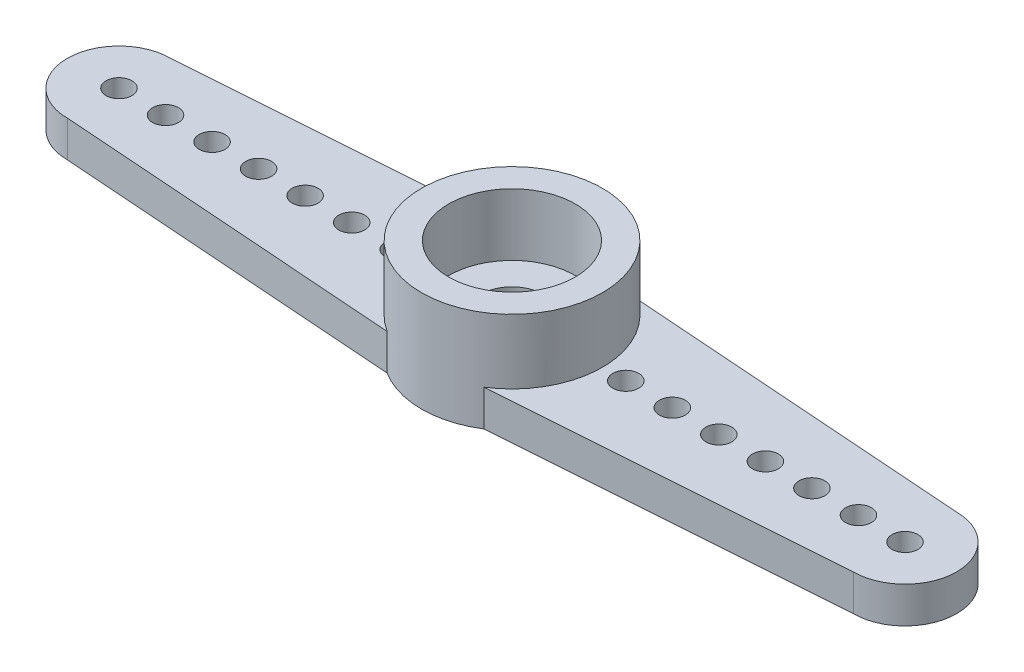
ISO-10303-21;
HEADER;
FILE_DESCRIPTION(('STEP AP214'),'2;1');
FILE_NAME('part.step','',(''),(''),'','','');
FILE_SCHEMA(('AUTOMOTIVE_DESIGN { 1 0 10303 214 1 1 1 1 }'));
ENDSEC;
DATA;
#1=APPLICATION_CONTEXT('core data for automotive mechanical design processes');
#2=APPLICATION_PROTOCOL_DEFINITION('international standard','automotive_design',2000,#1);
#3=PRODUCT_CONTEXT('',#1,'mechanical');
#4=PRODUCT('Part','Part','',(#3));
#5=PRODUCT_RELATED_PRODUCT_CATEGORY('part','',(#4));
#6=PRODUCT_DEFINITION_FORMATION('','',#4);
#7=PRODUCT_DEFINITION_CONTEXT('part definition',#1,'design');
#8=PRODUCT_DEFINITION('design','',#6,#7);
#9=PRODUCT_DEFINITION_SHAPE('','',#8);
#10=(LENGTH_UNIT() NAMED_UNIT(*) SI_UNIT(.MILLI.,.METRE.));
#11=(NAMED_UNIT(*) PLANE_ANGLE_UNIT() SI_UNIT($,.RADIAN.));
#12=(NAMED_UNIT(*) SI_UNIT($,.STERADIAN.) SOLID_ANGLE_UNIT());
#13=UNCERTAINTY_MEASURE_WITH_UNIT(LENGTH_MEASURE(1.E-05),#10,'distance_accuracy_value','');
#14=(GEOMETRIC_REPRESENTATION_CONTEXT(3) GLOBAL_UNCERTAINTY_ASSIGNED_CONTEXT((#13)) GLOBAL_UNIT_ASSIGNED_CONTEXT((#10,
#11,#12)) REPRESENTATION_CONTEXT('',''));
#15=CARTESIAN_POINT('',(0.,0.,0.));
#16=DIRECTION('',(0.,0.,1.));
#17=DIRECTION('',(1.,0.,0.));
#18=AXIS2_PLACEMENT_3D('',#15,#16,#17);
#19=CARTESIAN_POINT('',(-15.2,1.4,0.));
#20=DIRECTION('',(0.,1.,0.));
#21=DIRECTION('',(0.,0.,1.));
#22=AXIS2_PLACEMENT_3D('',#19,#20,#21);
#23=PLANE('',#22);
#24=CARTESIAN_POINT('',(-6.2,1.4,0.));
#25=DIRECTION('',(0.,1.,0.));
#26=DIRECTION('',(0.,0.,1.));
#27=AXIS2_PLACEMENT_3D('',#24,#25,#26);
#28=CIRCLE('',#27,0.500000000000001);
#29=CARTESIAN_POINT('',(-6.2,1.4,0.500000000000001));
#30=VERTEX_POINT('',#29);
#31=EDGE_CURVE('E190',#30,#30,#28,.T.);
#32=ORIENTED_EDGE('',*,*,#31,.F.);
#33=EDGE_LOOP('',(#32));
#34=FACE_BOUND('',#33,.T.);
#35=CARTESIAN_POINT('',(-9.8,1.4,0.));
#36=DIRECTION('',(0.,1.,0.));
#37=DIRECTION('',(0.,0.,1.));
#38=AXIS2_PLACEMENT_3D('',#35,#36,#37);
#39=CIRCLE('',#38,0.500000000000001);
#40=CARTESIAN_POINT('',(-9.8,1.4,0.500000000000001));
#41=VERTEX_POINT('',#40);
#42=EDGE_CURVE('E202',#41,#41,#39,.T.);
#43=ORIENTED_EDGE('',*,*,#42,.F.);
#44=EDGE_LOOP('',(#43));
#45=FACE_BOUND('',#44,.T.);
#46=CARTESIAN_POINT('',(-11.6,1.4,0.));
#47=DIRECTION('',(0.,1.,0.));
#48=DIRECTION('',(0.,0.,1.));
#49=AXIS2_PLACEMENT_3D('',#46,#47,#48);
#50=CIRCLE('',#49,0.499999999999999);
#51=CARTESIAN_POINT('',(-11.6,1.4,0.499999999999999));
#52=VERTEX_POINT('',#51);
#53=EDGE_CURVE('E208',#52,#52,#50,.T.);
#54=ORIENTED_EDGE('',*,*,#53,.F.);
#55=EDGE_LOOP('',(#54));
#56=FACE_BOUND('',#55,.T.);
#57=CARTESIAN_POINT('',(-13.4,1.4,0.));
#58=DIRECTION('',(0.,1.,0.));
#59=DIRECTION('',(0.,0.,1.));
#60=AXIS2_PLACEMENT_3D('',#57,#58,#59);
#61=CIRCLE('',#60,0.500000000000001);
#62=CARTESIAN_POINT('',(-13.4,1.4,0.500000000000001));
#63=VERTEX_POINT('',#62);
#64=EDGE_CURVE('E214',#63,#63,#61,.T.);
#65=ORIENTED_EDGE('',*,*,#64,.F.);
#66=EDGE_LOOP('',(#65));
#67=FACE_BOUND('',#66,.T.);
#68=CARTESIAN_POINT('',(-15.2,1.4,0.));
#69=DIRECTION('',(0.,1.,0.));
#70=DIRECTION('',(0.,0.,1.));
#71=AXIS2_PLACEMENT_3D('',#68,#69,#70);
#72=CIRCLE('',#71,0.500000000000001);
#73=CARTESIAN_POINT('',(-15.2,1.4,0.500000000000001));
#74=VERTEX_POINT('',#73);
#75=EDGE_CURVE('E101',#74,#74,#72,.T.);
#76=ORIENTED_EDGE('',*,*,#75,.F.);
#77=EDGE_LOOP('',(#76));
#78=FACE_BOUND('',#77,.T.);
#79=CARTESIAN_POINT('',(-8.,1.4,0.));
#80=DIRECTION('',(0.,1.,0.));
#81=DIRECTION('',(0.,0.,1.));
#82=AXIS2_PLACEMENT_3D('',#79,#80,#81);
#83=CIRCLE('',#82,0.500000000000001);
#84=CARTESIAN_POINT('',(-8.,1.4,0.500000000000001));
#85=VERTEX_POINT('',#84);
#86=EDGE_CURVE('E196',#85,#85,#83,.T.);
#87=ORIENTED_EDGE('',*,*,#86,.F.);
#88=EDGE_LOOP('',(#87));
#89=FACE_BOUND('',#88,.T.);
#90=CARTESIAN_POINT('',(-4.4,1.4,0.));
#91=DIRECTION('',(0.,1.,0.));
#92=DIRECTION('',(0.,0.,1.));
#93=AXIS2_PLACEMENT_3D('',#90,#91,#92);
#94=CIRCLE('',#93,0.500000000000001);
#95=CARTESIAN_POINT('',(-4.4,1.4,0.500000000000001));
#96=VERTEX_POINT('',#95);
#97=EDGE_CURVE('E184',#96,#96,#94,.T.);
#98=ORIENTED_EDGE('',*,*,#97,.F.);
#99=EDGE_LOOP('',(#98));
#100=FACE_BOUND('',#99,.T.);
#101=DIRECTION('',(0.997420198870011,0.,0.0717840294641297));
#102=VECTOR('',#101,1.);
#103=CARTESIAN_POINT('',(-15.2,1.4,2.));
#104=LINE('',#103,#102);
#105=CARTESIAN_POINT('',(-15.2,1.4,2.));
#106=VERTEX_POINT('',#105);
#107=CARTESIAN_POINT('',(-1.86858471289894,1.4,2.95945791838985));
#108=VERTEX_POINT('',#107);
#109=EDGE_CURVE('E228',#106,#108,#104,.T.);
#110=ORIENTED_EDGE('',*,*,#109,.T.);
#111=CARTESIAN_POINT('',(0.,1.4,0.));
#112=DIRECTION('',(0.,1.,0.));
#113=DIRECTION('',(0.,0.,1.));
#114=AXIS2_PLACEMENT_3D('',#111,#112,#113);
#115=CIRCLE('',#114,3.5);
#116=CARTESIAN_POINT('',(-1.86858471289894,1.4,-2.95945791838985));
#117=VERTEX_POINT('',#116);
#118=EDGE_CURVE('E123',#117,#108,#115,.T.);
#119=ORIENTED_EDGE('',*,*,#118,.F.);
#120=DIRECTION('',(-0.997420198870011,0.,0.0717840294641296));
#121=VECTOR('',#120,1.);
#122=CARTESIAN_POINT('',(-15.2,1.4,-2.));
#123=LINE('',#122,#121);
#124=CARTESIAN_POINT('',(-15.2,1.4,-2.));
#125=VERTEX_POINT('',#124);
#126=EDGE_CURVE('E54',#117,#125,#123,.T.);
#127=ORIENTED_EDGE('',*,*,#126,.T.);
#128=CARTESIAN_POINT('',(-15.2,1.4,0.));
#129=DIRECTION('',(0.,1.,0.));
#130=DIRECTION('',(0.,0.,1.));
#131=AXIS2_PLACEMENT_3D('',#128,#129,#130);
#132=CIRCLE('',#131,2.);
#133=EDGE_CURVE('E87',#125,#106,#132,.T.);
#134=ORIENTED_EDGE('',*,*,#133,.T.);
#135=EDGE_LOOP('',(#110,#119,#127,#134));
#136=FACE_BOUND('',#135,.T.);
#137=ADVANCED_FACE('F37',(#34,#45,#56,#67,#78,#89,#100,#136),#23,.T.);
#138=CARTESIAN_POINT('',(6.2,1.4,0.));
#139=DIRECTION('',(0.,1.,0.));
#140=DIRECTION('',(0.,0.,1.));
#141=AXIS2_PLACEMENT_3D('',#138,#139,#140);
#142=CIRCLE('',#141,0.499999999999997);
#143=CARTESIAN_POINT('',(6.2,1.4,0.500000000000053));
#144=VERTEX_POINT('',#143);
#145=EDGE_CURVE('E154',#144,#144,#142,.T.);
#146=ORIENTED_EDGE('',*,*,#145,.F.);
#147=EDGE_LOOP('',(#146));
#148=FACE_BOUND('',#147,.T.);
#149=CARTESIAN_POINT('',(9.8,1.4,0.));
#150=DIRECTION('',(0.,1.,0.));
#151=DIRECTION('',(0.,0.,1.));
#152=AXIS2_PLACEMENT_3D('',#149,#150,#151);
#153=CIRCLE('',#152,0.499999999999997);
#154=CARTESIAN_POINT('',(9.8,1.4,0.500000000000028));
#155=VERTEX_POINT('',#154);
#156=EDGE_CURVE('E166',#155,#155,#153,.T.);
#157=ORIENTED_EDGE('',*,*,#156,.F.);
#158=EDGE_LOOP('',(#157));
#159=FACE_BOUND('',#158,.T.);
#160=CARTESIAN_POINT('',(13.4,1.4,0.));
#161=DIRECTION('',(0.,1.,0.));
#162=DIRECTION('',(0.,0.,1.));
#163=AXIS2_PLACEMENT_3D('',#160,#161,#162);
#164=CIRCLE('',#163,0.499999999999997);
#165=CARTESIAN_POINT('',(13.4,1.4,0.500000000000003));
#166=VERTEX_POINT('',#165);
#167=EDGE_CURVE('E178',#166,#166,#164,.T.);
#168=ORIENTED_EDGE('',*,*,#167,.F.);
#169=EDGE_LOOP('',(#168));
#170=FACE_BOUND('',#169,.T.);
#171=CARTESIAN_POINT('',(15.2,1.4,0.));
#172=DIRECTION('',(0.,1.,0.));
#173=DIRECTION('',(0.,0.,1.));
#174=AXIS2_PLACEMENT_3D('',#171,#172,#173);
#175=CIRCLE('',#174,0.499999999999997);
#176=CARTESIAN_POINT('',(15.2,1.4,0.49999999999999));
#177=VERTEX_POINT('',#176);
#178=EDGE_CURVE('E220',#177,#177,#175,.T.);
#179=ORIENTED_EDGE('',*,*,#178,.F.);
#180=EDGE_LOOP('',(#179));
#181=FACE_BOUND('',#180,.T.);
#182=CARTESIAN_POINT('',(11.6,1.4,0.));
#183=DIRECTION('',(0.,1.,0.));
#184=DIRECTION('',(0.,0.,1.));
#185=AXIS2_PLACEMENT_3D('',#182,#183,#184);
#186=CIRCLE('',#185,0.499999999999999);
#187=CARTESIAN_POINT('',(11.6,1.4,0.500000000000017));
#188=VERTEX_POINT('',#187);
#189=EDGE_CURVE('E172',#188,#188,#186,.T.);
#190=ORIENTED_EDGE('',*,*,#189,.F.);
#191=EDGE_LOOP('',(#190));
#192=FACE_BOUND('',#191,.T.);
#193=CARTESIAN_POINT('',(8.,1.4,0.));
#194=DIRECTION('',(0.,1.,0.));
#195=DIRECTION('',(0.,0.,1.));
#196=AXIS2_PLACEMENT_3D('',#193,#194,#195);
#197=CIRCLE('',#196,0.499999999999997);
#198=CARTESIAN_POINT('',(8.,1.4,0.500000000000041));
#199=VERTEX_POINT('',#198);
#200=EDGE_CURVE('E160',#199,#199,#197,.T.);
#201=ORIENTED_EDGE('',*,*,#200,.F.);
#202=EDGE_LOOP('',(#201));
#203=FACE_BOUND('',#202,.T.);
#204=CARTESIAN_POINT('',(4.4,1.4,0.));
#205=DIRECTION('',(0.,1.,0.));
#206=DIRECTION('',(0.,0.,1.));
#207=AXIS2_PLACEMENT_3D('',#204,#205,#206);
#208=CIRCLE('',#207,0.499999999999997);
#209=CARTESIAN_POINT('',(4.4,1.4,0.500000000000066));
#210=VERTEX_POINT('',#209);
#211=EDGE_CURVE('E148',#210,#210,#208,.T.);
#212=ORIENTED_EDGE('',*,*,#211,.F.);
#213=EDGE_LOOP('',(#212));
#214=FACE_BOUND('',#213,.T.);
#215=CARTESIAN_POINT('',(1.86858471289894,1.4,2.95945791838985));
#216=VERTEX_POINT('',#215);
#217=CARTESIAN_POINT('',(1.86858471289894,1.4,-2.95945791838985));
#218=VERTEX_POINT('',#217);
#219=EDGE_CURVE('E139',#216,#218,#115,.T.);
#220=ORIENTED_EDGE('',*,*,#219,.F.);
#221=DIRECTION('',(0.997420198870011,0.,-0.0717840294641297));
#222=VECTOR('',#221,1.);
#223=CARTESIAN_POINT('',(-14.9001527327747,1.4,4.16629887091939));
#224=LINE('',#223,#222);
#225=CARTESIAN_POINT('',(15.2,1.4,2.));
#226=VERTEX_POINT('',#225);
#227=EDGE_CURVE('E126',#216,#226,#224,.T.);
#228=ORIENTED_EDGE('',*,*,#227,.T.);
#229=CARTESIAN_POINT('',(15.2,1.4,0.));
#230=DIRECTION('',(0.,1.,0.));
#231=DIRECTION('',(0.,0.,-1.));
#232=AXIS2_PLACEMENT_3D('',#229,#230,#231);
#233=CIRCLE('',#232,2.);
#234=CARTESIAN_POINT('',(15.2,1.4,-2.));
#235=VERTEX_POINT('',#234);
#236=EDGE_CURVE('E230',#226,#235,#233,.T.);
#237=ORIENTED_EDGE('',*,*,#236,.T.);
#238=DIRECTION('',(-0.997420198870011,0.,-0.0717840294641295));
#239=VECTOR('',#238,1.);
#240=CARTESIAN_POINT('',(-14.9001527327747,1.4,-4.16629887091939));
#241=LINE('',#240,#239);
#242=EDGE_CURVE('E131',#235,#218,#241,.T.);
#243=ORIENTED_EDGE('',*,*,#242,.T.);
#244=EDGE_LOOP('',(#220,#228,#237,#243));
#245=FACE_BOUND('',#244,.T.);
#246=ADVANCED_FACE('F238',(#148,#159,#170,#181,#192,#203,#214,#245),#23,.T.);
#247=CARTESIAN_POINT('',(-15.2,0.,0.));
#248=DIRECTION('',(0.,1.,0.));
#249=DIRECTION('',(0.,0.,1.));
#250=AXIS2_PLACEMENT_3D('',#247,#248,#249);
#251=PLANE('',#250);
#252=CARTESIAN_POINT('',(0.,0.,0.));
#253=DIRECTION('',(0.,-1.,0.));
#254=DIRECTION('',(0.,0.,-1.));
#255=AXIS2_PLACEMENT_3D('',#252,#253,#254);
#256=CIRCLE('',#255,2.35);
#257=CARTESIAN_POINT('',(0.,0.,-2.35));
#258=VERTEX_POINT('',#257);
#259=EDGE_CURVE('E138',#258,#258,#256,.T.);
#260=ORIENTED_EDGE('',*,*,#259,.F.);
#261=EDGE_LOOP('',(#260));
#262=FACE_BOUND('',#261,.T.);
#263=CARTESIAN_POINT('',(-15.2,0.,0.));
#264=DIRECTION('',(0.,1.,0.));
#265=DIRECTION('',(0.,0.,1.));
#266=AXIS2_PLACEMENT_3D('',#263,#264,#265);
#267=CIRCLE('',#266,0.500000000000001);
#268=CARTESIAN_POINT('',(-15.2,0.,0.500000000000001));
#269=VERTEX_POINT('',#268);
#270=EDGE_CURVE('E105',#269,#269,#267,.T.);
#271=ORIENTED_EDGE('',*,*,#270,.T.);
#272=EDGE_LOOP('',(#271));
#273=FACE_BOUND('',#272,.T.);
#274=CARTESIAN_POINT('',(15.2,0.,0.));
#275=DIRECTION('',(0.,1.,0.));
#276=DIRECTION('',(0.,0.,1.));
#277=AXIS2_PLACEMENT_3D('',#274,#275,#276);
#278=CIRCLE('',#277,0.499999999999997);
#279=CARTESIAN_POINT('',(15.2,0.,0.49999999999999));
#280=VERTEX_POINT('',#279);
#281=EDGE_CURVE('E217',#280,#280,#278,.T.);
#282=ORIENTED_EDGE('',*,*,#281,.T.);
#283=EDGE_LOOP('',(#282));
#284=FACE_BOUND('',#283,.T.);
#285=CARTESIAN_POINT('',(-13.4,0.,0.));
#286=DIRECTION('',(0.,1.,0.));
#287=DIRECTION('',(0.,0.,1.));
#288=AXIS2_PLACEMENT_3D('',#285,#286,#287);
#289=CIRCLE('',#288,0.500000000000001);
#290=CARTESIAN_POINT('',(-13.4,0.,0.500000000000001));
#291=VERTEX_POINT('',#290);
#292=EDGE_CURVE('E211',#291,#291,#289,.T.);
#293=ORIENTED_EDGE('',*,*,#292,.T.);
#294=EDGE_LOOP('',(#293));
#295=FACE_BOUND('',#294,.T.);
#296=CARTESIAN_POINT('',(-11.6,0.,0.));
#297=DIRECTION('',(0.,1.,0.));
#298=DIRECTION('',(0.,0.,1.));
#299=AXIS2_PLACEMENT_3D('',#296,#297,#298);
#300=CIRCLE('',#299,0.499999999999999);
#301=CARTESIAN_POINT('',(-11.6,0.,0.499999999999999));
#302=VERTEX_POINT('',#301);
#303=EDGE_CURVE('E205',#302,#302,#300,.T.);
#304=ORIENTED_EDGE('',*,*,#303,.T.);
#305=EDGE_LOOP('',(#304));
#306=FACE_BOUND('',#305,.T.);
#307=CARTESIAN_POINT('',(-9.8,0.,0.));
#308=DIRECTION('',(0.,1.,0.));
#309=DIRECTION('',(0.,0.,1.));
#310=AXIS2_PLACEMENT_3D('',#307,#308,#309);
#311=CIRCLE('',#310,0.500000000000001);
#312=CARTESIAN_POINT('',(-9.8,0.,0.500000000000001));
#313=VERTEX_POINT('',#312);
#314=EDGE_CURVE('E199',#313,#313,#311,.T.);
#315=ORIENTED_EDGE('',*,*,#314,.T.);
#316=EDGE_LOOP('',(#315));
#317=FACE_BOUND('',#316,.T.);
#318=CARTESIAN_POINT('',(-8.,0.,0.));
#319=DIRECTION('',(0.,1.,0.));
#320=DIRECTION('',(0.,0.,1.));
#321=AXIS2_PLACEMENT_3D('',#318,#319,#320);
#322=CIRCLE('',#321,0.500000000000001);
#323=CARTESIAN_POINT('',(-8.,0.,0.500000000000001));
#324=VERTEX_POINT('',#323);
#325=EDGE_CURVE('E193',#324,#324,#322,.T.);
#326=ORIENTED_EDGE('',*,*,#325,.T.);
#327=EDGE_LOOP('',(#326));
#328=FACE_BOUND('',#327,.T.);
#329=CARTESIAN_POINT('',(-6.2,0.,0.));
#330=DIRECTION('',(0.,1.,0.));
#331=DIRECTION('',(0.,0.,1.));
#332=AXIS2_PLACEMENT_3D('',#329,#330,#331);
#333=CIRCLE('',#332,0.500000000000001);
#334=CARTESIAN_POINT('',(-6.2,0.,0.500000000000001));
#335=VERTEX_POINT('',#334);
#336=EDGE_CURVE('E187',#335,#335,#333,.T.);
#337=ORIENTED_EDGE('',*,*,#336,.T.);
#338=EDGE_LOOP('',(#337));
#339=FACE_BOUND('',#338,.T.);
#340=CARTESIAN_POINT('',(-4.4,0.,0.));
#341=DIRECTION('',(0.,1.,0.));
#342=DIRECTION('',(0.,0.,1.));
#343=AXIS2_PLACEMENT_3D('',#340,#341,#342);
#344=CIRCLE('',#343,0.500000000000001);
#345=CARTESIAN_POINT('',(-4.4,0.,0.500000000000001));
#346=VERTEX_POINT('',#345);
#347=EDGE_CURVE('E181',#346,#346,#344,.T.);
#348=ORIENTED_EDGE('',*,*,#347,.T.);
#349=EDGE_LOOP('',(#348));
#350=FACE_BOUND('',#349,.T.);
#351=CARTESIAN_POINT('',(13.4,0.,0.));
#352=DIRECTION('',(0.,1.,0.));
#353=DIRECTION('',(0.,0.,1.));
#354=AXIS2_PLACEMENT_3D('',#351,#352,#353);
#355=CIRCLE('',#354,0.499999999999997);
#356=CARTESIAN_POINT('',(13.4,0.,0.500000000000003));
#357=VERTEX_POINT('',#356);
#358=EDGE_CURVE('E175',#357,#357,#355,.T.);
#359=ORIENTED_EDGE('',*,*,#358,.T.);
#360=EDGE_LOOP('',(#359));
#361=FACE_BOUND('',#360,.T.);
#362=CARTESIAN_POINT('',(11.6,0.,0.));
#363=DIRECTION('',(0.,1.,0.));
#364=DIRECTION('',(0.,0.,1.));
#365=AXIS2_PLACEMENT_3D('',#362,#363,#364);
#366=CIRCLE('',#365,0.499999999999999);
#367=CARTESIAN_POINT('',(11.6,0.,0.500000000000017));
#368=VERTEX_POINT('',#367);
#369=EDGE_CURVE('E169',#368,#368,#366,.T.);
#370=ORIENTED_EDGE('',*,*,#369,.T.);
#371=EDGE_LOOP('',(#370));
#372=FACE_BOUND('',#371,.T.);
#373=CARTESIAN_POINT('',(9.8,0.,0.));
#374=DIRECTION('',(0.,1.,0.));
#375=DIRECTION('',(0.,0.,1.));
#376=AXIS2_PLACEMENT_3D('',#373,#374,#375);
#377=CIRCLE('',#376,0.499999999999997);
#378=CARTESIAN_POINT('',(9.8,0.,0.500000000000028));
#379=VERTEX_POINT('',#378);
#380=EDGE_CURVE('E163',#379,#379,#377,.T.);
#381=ORIENTED_EDGE('',*,*,#380,.T.);
#382=EDGE_LOOP('',(#381));
#383=FACE_BOUND('',#382,.T.);
#384=CARTESIAN_POINT('',(8.,0.,0.));
#385=DIRECTION('',(0.,1.,0.));
#386=DIRECTION('',(0.,0.,1.));
#387=AXIS2_PLACEMENT_3D('',#384,#385,#386);
#388=CIRCLE('',#387,0.499999999999997);
#389=CARTESIAN_POINT('',(8.,0.,0.500000000000041));
#390=VERTEX_POINT('',#389);
#391=EDGE_CURVE('E157',#390,#390,#388,.T.);
#392=ORIENTED_EDGE('',*,*,#391,.T.);
#393=EDGE_LOOP('',(#392));
#394=FACE_BOUND('',#393,.T.);
#395=CARTESIAN_POINT('',(6.2,0.,0.));
#396=DIRECTION('',(0.,1.,0.));
#397=DIRECTION('',(0.,0.,1.));
#398=AXIS2_PLACEMENT_3D('',#395,#396,#397);
#399=CIRCLE('',#398,0.499999999999997);
#400=CARTESIAN_POINT('',(6.2,0.,0.500000000000053));
#401=VERTEX_POINT('',#400);
#402=EDGE_CURVE('E151',#401,#401,#399,.T.);
#403=ORIENTED_EDGE('',*,*,#402,.T.);
#404=EDGE_LOOP('',(#403));
#405=FACE_BOUND('',#404,.T.);
#406=CARTESIAN_POINT('',(4.4,0.,0.));
#407=DIRECTION('',(0.,1.,0.));
#408=DIRECTION('',(0.,0.,1.));
#409=AXIS2_PLACEMENT_3D('',#406,#407,#408);
#410=CIRCLE('',#409,0.499999999999997);
#411=CARTESIAN_POINT('',(4.4,0.,0.500000000000066));
#412=VERTEX_POINT('',#411);
#413=EDGE_CURVE('E145',#412,#412,#410,.T.);
#414=ORIENTED_EDGE('',*,*,#413,.T.);
#415=EDGE_LOOP('',(#414));
#416=FACE_BOUND('',#415,.T.);
#417=CARTESIAN_POINT('',(0.,0.,0.));
#418=DIRECTION('',(0.,-1.,0.));
#419=DIRECTION('',(0.,0.,-1.));
#420=AXIS2_PLACEMENT_3D('',#417,#418,#419);
#421=CIRCLE('',#420,3.5);
#422=CARTESIAN_POINT('',(1.86858471289894,0.,2.95945791838985));
#423=VERTEX_POINT('',#422);
#424=CARTESIAN_POINT('',(-1.86858471289894,0.,2.95945791838985));
#425=VERTEX_POINT('',#424);
#426=EDGE_CURVE('E260',#423,#425,#421,.T.);
#427=ORIENTED_EDGE('',*,*,#426,.T.);
#428=DIRECTION('',(0.997420198870011,0.,0.0717840294641297));
#429=VECTOR('',#428,1.);
#430=CARTESIAN_POINT('',(-15.2,0.,2.));
#431=LINE('',#430,#429);
#432=CARTESIAN_POINT('',(-15.2,0.,2.));
#433=VERTEX_POINT('',#432);
#434=EDGE_CURVE('E99',#433,#425,#431,.T.);
#435=ORIENTED_EDGE('',*,*,#434,.F.);
#436=CARTESIAN_POINT('',(-15.2,0.,0.));
#437=DIRECTION('',(0.,1.,0.));
#438=DIRECTION('',(0.,0.,1.));
#439=AXIS2_PLACEMENT_3D('',#436,#437,#438);
#440=CIRCLE('',#439,2.);
#441=CARTESIAN_POINT('',(-15.2,0.,-2.));
#442=VERTEX_POINT('',#441);
#443=EDGE_CURVE('E93',#442,#433,#440,.T.);
#444=ORIENTED_EDGE('',*,*,#443,.F.);
#445=DIRECTION('',(-0.997420198870011,0.,0.0717840294641296));
#446=VECTOR('',#445,1.);
#447=CARTESIAN_POINT('',(-15.2,0.,-2.));
#448=LINE('',#447,#446);
#449=CARTESIAN_POINT('',(-1.86858471289894,0.,-2.95945791838985));
#450=VERTEX_POINT('',#449);
#451=EDGE_CURVE('E75',#450,#442,#448,.T.);
#452=ORIENTED_EDGE('',*,*,#451,.F.);
#453=CARTESIAN_POINT('',(0.,0.,0.));
#454=DIRECTION('',(0.,-1.,0.));
#455=DIRECTION('',(0.,0.,-1.));
#456=AXIS2_PLACEMENT_3D('',#453,#454,#455);
#457=CIRCLE('',#456,3.5);
#458=CARTESIAN_POINT('',(1.86858471289894,0.,-2.95945791838985));
#459=VERTEX_POINT('',#458);
#460=EDGE_CURVE('E258',#450,#459,#457,.T.);
#461=ORIENTED_EDGE('',*,*,#460,.T.);
#462=DIRECTION('',(0.997420198870011,0.,0.0717840294641295));
#463=VECTOR('',#462,1.);
#464=CARTESIAN_POINT('',(1.86858471289894,0.,-2.95945791838985));
#465=LINE('',#464,#463);
#466=CARTESIAN_POINT('',(15.2,0.,-2.));
#467=VERTEX_POINT('',#466);
#468=EDGE_CURVE('E255',#459,#467,#465,.T.);
#469=ORIENTED_EDGE('',*,*,#468,.T.);
#470=CARTESIAN_POINT('',(15.2,0.,0.));
#471=DIRECTION('',(0.,1.,0.));
#472=DIRECTION('',(0.,0.,-1.));
#473=AXIS2_PLACEMENT_3D('',#470,#471,#472);
#474=CIRCLE('',#473,2.);
#475=CARTESIAN_POINT('',(15.2,0.,1.99999999999999));
#476=VERTEX_POINT('',#475);
#477=EDGE_CURVE('E88',#476,#467,#474,.T.);
#478=ORIENTED_EDGE('',*,*,#477,.F.);
#479=DIRECTION('',(-0.997420198870011,0.,0.0717840294641296));
#480=VECTOR('',#479,1.);
#481=CARTESIAN_POINT('',(15.2,0.,2.));
#482=LINE('',#481,#480);
#483=EDGE_CURVE('E69',#476,#423,#482,.T.);
#484=ORIENTED_EDGE('',*,*,#483,.T.);
#485=EDGE_LOOP('',(#427,#435,#444,#452,#461,#469,#478,#484));
#486=FACE_BOUND('',#485,.T.);
#487=ADVANCED_FACE('F97',(#262,#273,#284,#295,#306,#317,#328,#339,#350,#361,#372,#383,#394,#405,
#416,#486),#251,.F.);
#488=CARTESIAN_POINT('',(-15.2,1.4,0.));
#489=DIRECTION('',(0.,-1.,0.));
#490=DIRECTION('',(0.,0.,-1.));
#491=AXIS2_PLACEMENT_3D('',#488,#489,#490);
#492=CYLINDRICAL_SURFACE('',#491,2.);
#493=ORIENTED_EDGE('',*,*,#443,.T.);
#494=DIRECTION('',(0.,-1.,0.));
#495=VECTOR('',#494,1.);
#496=CARTESIAN_POINT('',(-15.2,1.4,2.));
#497=LINE('',#496,#495);
#498=EDGE_CURVE('E46',#106,#433,#497,.T.);
#499=ORIENTED_EDGE('',*,*,#498,.F.);
#500=ORIENTED_EDGE('',*,*,#133,.F.);
#501=DIRECTION('',(0.,-1.,0.));
#502=VECTOR('',#501,1.);
#503=CARTESIAN_POINT('',(-15.2,1.4,-2.));
#504=LINE('',#503,#502);
#505=EDGE_CURVE('E78',#125,#442,#504,.T.);
#506=ORIENTED_EDGE('',*,*,#505,.T.);
#507=EDGE_LOOP('',(#493,#499,#500,#506));
#508=FACE_BOUND('',#507,.T.);
#509=ADVANCED_FACE('F39',(#508),#492,.T.);
#510=CARTESIAN_POINT('',(-15.2,1.4,2.));
#511=DIRECTION('',(0.0717840294641297,0.,-0.997420198870011));
#512=DIRECTION('',(-0.997420198870011,0.,-0.0717840294641297));
#513=AXIS2_PLACEMENT_3D('',#510,#511,#512);
#514=PLANE('',#513);
#515=ORIENTED_EDGE('',*,*,#434,.T.);
#516=DIRECTION('',(0.,-1.,0.));
#517=VECTOR('',#516,1.);
#518=CARTESIAN_POINT('',(-1.86858471289894,3.9,2.95945791838985));
#519=LINE('',#518,#517);
#520=EDGE_CURVE('E265',#108,#425,#519,.T.);
#521=ORIENTED_EDGE('',*,*,#520,.F.);
#522=ORIENTED_EDGE('',*,*,#109,.F.);
#523=ORIENTED_EDGE('',*,*,#498,.T.);
#524=EDGE_LOOP('',(#515,#521,#522,#523));
#525=FACE_BOUND('',#524,.T.);
#526=ADVANCED_FACE('F286',(#525),#514,.F.);
#527=CARTESIAN_POINT('',(15.2,1.4,0.));
#528=DIRECTION('',(0.,-1.,0.));
#529=DIRECTION('',(0.,0.,-1.));
#530=AXIS2_PLACEMENT_3D('',#527,#528,#529);
#531=CYLINDRICAL_SURFACE('',#530,2.);
#532=ORIENTED_EDGE('',*,*,#477,.T.);
#533=DIRECTION('',(0.,-1.,0.));
#534=VECTOR('',#533,1.);
#535=CARTESIAN_POINT('',(15.2,1.4,-2.00000000000001));
#536=LINE('',#535,#534);
#537=EDGE_CURVE('E94',#235,#467,#536,.T.);
#538=ORIENTED_EDGE('',*,*,#537,.F.);
#539=ORIENTED_EDGE('',*,*,#236,.F.);
#540=DIRECTION('',(0.,-1.,0.));
#541=VECTOR('',#540,1.);
#542=CARTESIAN_POINT('',(15.2,1.4,1.99999999999999));
#543=LINE('',#542,#541);
#544=EDGE_CURVE('E114',#226,#476,#543,.T.);
#545=ORIENTED_EDGE('',*,*,#544,.T.);
#546=EDGE_LOOP('',(#532,#538,#539,#545));
#547=FACE_BOUND('',#546,.T.);
#548=ADVANCED_FACE('F246',(#547),#531,.T.);
#549=CARTESIAN_POINT('',(-15.2,1.4,-2.));
#550=DIRECTION('',(0.0717840294641296,0.,0.997420198870011));
#551=DIRECTION('',(0.997420198870011,0.,-0.0717840294641296));
#552=AXIS2_PLACEMENT_3D('',#549,#550,#551);
#553=PLANE('',#552);
#554=ORIENTED_EDGE('',*,*,#451,.T.);
#555=ORIENTED_EDGE('',*,*,#505,.F.);
#556=ORIENTED_EDGE('',*,*,#126,.F.);
#557=DIRECTION('',(0.,-1.,0.));
#558=VECTOR('',#557,1.);
#559=CARTESIAN_POINT('',(-1.86858471289894,3.9,-2.95945791838985));
#560=LINE('',#559,#558);
#561=EDGE_CURVE('E82',#117,#450,#560,.T.);
#562=ORIENTED_EDGE('',*,*,#561,.T.);
#563=EDGE_LOOP('',(#554,#555,#556,#562));
#564=FACE_BOUND('',#563,.T.);
#565=ADVANCED_FACE('F77',(#564),#553,.F.);
#566=CARTESIAN_POINT('',(-15.2,1.4,0.));
#567=DIRECTION('',(0.,-1.,0.));
#568=DIRECTION('',(0.,0.,-1.));
#569=AXIS2_PLACEMENT_3D('',#566,#567,#568);
#570=CYLINDRICAL_SURFACE('',#569,0.500000000000001);
#571=ORIENTED_EDGE('',*,*,#75,.T.);
#572=EDGE_LOOP('',(#571));
#573=FACE_BOUND('',#572,.T.);
#574=ORIENTED_EDGE('',*,*,#270,.F.);
#575=EDGE_LOOP('',(#574));
#576=FACE_BOUND('',#575,.T.);
#577=ADVANCED_FACE('F311',(#573,#576),#570,.F.);
#578=CARTESIAN_POINT('',(15.2,1.4,0.));
#579=DIRECTION('',(0.,-1.,0.));
#580=DIRECTION('',(0.,0.,-1.));
#581=AXIS2_PLACEMENT_3D('',#578,#579,#580);
#582=CYLINDRICAL_SURFACE('',#581,0.499999999999997);
#583=ORIENTED_EDGE('',*,*,#178,.T.);
#584=EDGE_LOOP('',(#583));
#585=FACE_BOUND('',#584,.T.);
#586=ORIENTED_EDGE('',*,*,#281,.F.);
#587=EDGE_LOOP('',(#586));
#588=FACE_BOUND('',#587,.T.);
#589=ADVANCED_FACE('F513',(#585,#588),#582,.F.);
#590=CARTESIAN_POINT('',(-13.4,1.4,0.));
#591=DIRECTION('',(0.,-1.,0.));
#592=DIRECTION('',(0.,0.,-1.));
#593=AXIS2_PLACEMENT_3D('',#590,#591,#592);
#594=CYLINDRICAL_SURFACE('',#593,0.500000000000001);
#595=ORIENTED_EDGE('',*,*,#64,.T.);
#596=EDGE_LOOP('',(#595));
#597=FACE_BOUND('',#596,.T.);
#598=ORIENTED_EDGE('',*,*,#292,.F.);
#599=EDGE_LOOP('',(#598));
#600=FACE_BOUND('',#599,.T.);
#601=ADVANCED_FACE('F503',(#597,#600),#594,.F.);
#602=CARTESIAN_POINT('',(-11.6,1.4,0.));
#603=DIRECTION('',(0.,-1.,0.));
#604=DIRECTION('',(0.,0.,-1.));
#605=AXIS2_PLACEMENT_3D('',#602,#603,#604);
#606=CYLINDRICAL_SURFACE('',#605,0.499999999999999);
#607=ORIENTED_EDGE('',*,*,#53,.T.);
#608=EDGE_LOOP('',(#607));
#609=FACE_BOUND('',#608,.T.);
#610=ORIENTED_EDGE('',*,*,#303,.F.);
#611=EDGE_LOOP('',(#610));
#612=FACE_BOUND('',#611,.T.);
#613=ADVANCED_FACE('F493',(#609,#612),#606,.F.);
#614=CARTESIAN_POINT('',(-9.8,1.4,0.));
#615=DIRECTION('',(0.,-1.,0.));
#616=DIRECTION('',(0.,0.,-1.));
#617=AXIS2_PLACEMENT_3D('',#614,#615,#616);
#618=CYLINDRICAL_SURFACE('',#617,0.500000000000001);
#619=ORIENTED_EDGE('',*,*,#42,.T.);
#620=EDGE_LOOP('',(#619));
#621=FACE_BOUND('',#620,.T.);
#622=ORIENTED_EDGE('',*,*,#314,.F.);
#623=EDGE_LOOP('',(#622));
#624=FACE_BOUND('',#623,.T.);
#625=ADVANCED_FACE('F483',(#621,#624),#618,.F.);
#626=CARTESIAN_POINT('',(-8.,1.4,0.));
#627=DIRECTION('',(0.,-1.,0.));
#628=DIRECTION('',(0.,0.,-1.));
#629=AXIS2_PLACEMENT_3D('',#626,#627,#628);
#630=CYLINDRICAL_SURFACE('',#629,0.500000000000001);
#631=ORIENTED_EDGE('',*,*,#86,.T.);
#632=EDGE_LOOP('',(#631));
#633=FACE_BOUND('',#632,.T.);
#634=ORIENTED_EDGE('',*,*,#325,.F.);
#635=EDGE_LOOP('',(#634));
#636=FACE_BOUND('',#635,.T.);
#637=ADVANCED_FACE('F473',(#633,#636),#630,.F.);
#638=CARTESIAN_POINT('',(-6.2,1.4,0.));
#639=DIRECTION('',(0.,-1.,0.));
#640=DIRECTION('',(0.,0.,-1.));
#641=AXIS2_PLACEMENT_3D('',#638,#639,#640);
#642=CYLINDRICAL_SURFACE('',#641,0.500000000000001);
#643=ORIENTED_EDGE('',*,*,#31,.T.);
#644=EDGE_LOOP('',(#643));
#645=FACE_BOUND('',#644,.T.);
#646=ORIENTED_EDGE('',*,*,#336,.F.);
#647=EDGE_LOOP('',(#646));
#648=FACE_BOUND('',#647,.T.);
#649=ADVANCED_FACE('F463',(#645,#648),#642,.F.);
#650=CARTESIAN_POINT('',(-4.4,1.4,0.));
#651=DIRECTION('',(0.,-1.,0.));
#652=DIRECTION('',(0.,0.,-1.));
#653=AXIS2_PLACEMENT_3D('',#650,#651,#652);
#654=CYLINDRICAL_SURFACE('',#653,0.500000000000001);
#655=ORIENTED_EDGE('',*,*,#97,.T.);
#656=EDGE_LOOP('',(#655));
#657=FACE_BOUND('',#656,.T.);
#658=ORIENTED_EDGE('',*,*,#347,.F.);
#659=EDGE_LOOP('',(#658));
#660=FACE_BOUND('',#659,.T.);
#661=ADVANCED_FACE('F453',(#657,#660),#654,.F.);
#662=CARTESIAN_POINT('',(13.4,1.4,0.));
#663=DIRECTION('',(0.,-1.,0.));
#664=DIRECTION('',(0.,0.,-1.));
#665=AXIS2_PLACEMENT_3D('',#662,#663,#664);
#666=CYLINDRICAL_SURFACE('',#665,0.499999999999997);
#667=ORIENTED_EDGE('',*,*,#167,.T.);
#668=EDGE_LOOP('',(#667));
#669=FACE_BOUND('',#668,.T.);
#670=ORIENTED_EDGE('',*,*,#358,.F.);
#671=EDGE_LOOP('',(#670));
#672=FACE_BOUND('',#671,.T.);
#673=ADVANCED_FACE('F443',(#669,#672),#666,.F.);
#674=CARTESIAN_POINT('',(11.6,1.4,0.));
#675=DIRECTION('',(0.,-1.,0.));
#676=DIRECTION('',(0.,0.,-1.));
#677=AXIS2_PLACEMENT_3D('',#674,#675,#676);
#678=CYLINDRICAL_SURFACE('',#677,0.499999999999999);
#679=ORIENTED_EDGE('',*,*,#189,.T.);
#680=EDGE_LOOP('',(#679));
#681=FACE_BOUND('',#680,.T.);
#682=ORIENTED_EDGE('',*,*,#369,.F.);
#683=EDGE_LOOP('',(#682));
#684=FACE_BOUND('',#683,.T.);
#685=ADVANCED_FACE('F433',(#681,#684),#678,.F.);
#686=CARTESIAN_POINT('',(9.8,1.4,0.));
#687=DIRECTION('',(0.,-1.,0.));
#688=DIRECTION('',(0.,0.,-1.));
#689=AXIS2_PLACEMENT_3D('',#686,#687,#688);
#690=CYLINDRICAL_SURFACE('',#689,0.499999999999997);
#691=ORIENTED_EDGE('',*,*,#156,.T.);
#692=EDGE_LOOP('',(#691));
#693=FACE_BOUND('',#692,.T.);
#694=ORIENTED_EDGE('',*,*,#380,.F.);
#695=EDGE_LOOP('',(#694));
#696=FACE_BOUND('',#695,.T.);
#697=ADVANCED_FACE('F423',(#693,#696),#690,.F.);
#698=CARTESIAN_POINT('',(8.,1.4,0.));
#699=DIRECTION('',(0.,-1.,0.));
#700=DIRECTION('',(0.,0.,-1.));
#701=AXIS2_PLACEMENT_3D('',#698,#699,#700);
#702=CYLINDRICAL_SURFACE('',#701,0.499999999999997);
#703=ORIENTED_EDGE('',*,*,#200,.T.);
#704=EDGE_LOOP('',(#703));
#705=FACE_BOUND('',#704,.T.);
#706=ORIENTED_EDGE('',*,*,#391,.F.);
#707=EDGE_LOOP('',(#706));
#708=FACE_BOUND('',#707,.T.);
#709=ADVANCED_FACE('F413',(#705,#708),#702,.F.);
#710=CARTESIAN_POINT('',(6.2,1.4,0.));
#711=DIRECTION('',(0.,-1.,0.));
#712=DIRECTION('',(0.,0.,-1.));
#713=AXIS2_PLACEMENT_3D('',#710,#711,#712);
#714=CYLINDRICAL_SURFACE('',#713,0.499999999999997);
#715=ORIENTED_EDGE('',*,*,#145,.T.);
#716=EDGE_LOOP('',(#715));
#717=FACE_BOUND('',#716,.T.);
#718=ORIENTED_EDGE('',*,*,#402,.F.);
#719=EDGE_LOOP('',(#718));
#720=FACE_BOUND('',#719,.T.);
#721=ADVANCED_FACE('F403',(#717,#720),#714,.F.);
#722=CARTESIAN_POINT('',(4.4,1.4,0.));
#723=DIRECTION('',(0.,-1.,0.));
#724=DIRECTION('',(0.,0.,-1.));
#725=AXIS2_PLACEMENT_3D('',#722,#723,#724);
#726=CYLINDRICAL_SURFACE('',#725,0.499999999999997);
#727=ORIENTED_EDGE('',*,*,#211,.T.);
#728=EDGE_LOOP('',(#727));
#729=FACE_BOUND('',#728,.T.);
#730=ORIENTED_EDGE('',*,*,#413,.F.);
#731=EDGE_LOOP('',(#730));
#732=FACE_BOUND('',#731,.T.);
#733=ADVANCED_FACE('F393',(#729,#732),#726,.F.);
#734=CARTESIAN_POINT('',(0.,1.,0.));
#735=DIRECTION('',(0.,-1.,0.));
#736=DIRECTION('',(0.,0.,-1.));
#737=AXIS2_PLACEMENT_3D('',#734,#735,#736);
#738=CYLINDRICAL_SURFACE('',#737,2.35);
#739=CARTESIAN_POINT('',(0.,1.,0.));
#740=DIRECTION('',(0.,-1.,0.));
#741=DIRECTION('',(0.,0.,-1.));
#742=AXIS2_PLACEMENT_3D('',#739,#740,#741);
#743=CIRCLE('',#742,2.35);
#744=CARTESIAN_POINT('',(0.,1.,-2.35));
#745=VERTEX_POINT('',#744);
#746=EDGE_CURVE('E142',#745,#745,#743,.T.);
#747=ORIENTED_EDGE('',*,*,#746,.F.);
#748=EDGE_LOOP('',(#747));
#749=FACE_BOUND('',#748,.T.);
#750=ORIENTED_EDGE('',*,*,#259,.T.);
#751=EDGE_LOOP('',(#750));
#752=FACE_BOUND('',#751,.T.);
#753=ADVANCED_FACE('F381',(#749,#752),#738,.F.);
#754=CARTESIAN_POINT('',(0.,1.,0.));
#755=DIRECTION('',(0.,-1.,0.));
#756=DIRECTION('',(0.,0.,-1.));
#757=AXIS2_PLACEMENT_3D('',#754,#755,#756);
#758=PLANE('',#757);
#759=CARTESIAN_POINT('',(0.,1.,0.));
#760=DIRECTION('',(0.,-1.,0.));
#761=DIRECTION('',(0.,0.,-1.));
#762=AXIS2_PLACEMENT_3D('',#759,#760,#761);
#763=CIRCLE('',#762,1.2);
#764=CARTESIAN_POINT('',(0.,1.,-1.2));
#765=VERTEX_POINT('',#764);
#766=EDGE_CURVE('E116',#765,#765,#763,.T.);
#767=ORIENTED_EDGE('',*,*,#766,.F.);
#768=EDGE_LOOP('',(#767));
#769=FACE_BOUND('',#768,.T.);
#770=ORIENTED_EDGE('',*,*,#746,.T.);
#771=EDGE_LOOP('',(#770));
#772=FACE_BOUND('',#771,.T.);
#773=ADVANCED_FACE('F375',(#769,#772),#758,.T.);
#774=CARTESIAN_POINT('',(0.,3.9,0.));
#775=DIRECTION('',(0.,1.,0.));
#776=DIRECTION('',(0.,0.,1.));
#777=AXIS2_PLACEMENT_3D('',#774,#775,#776);
#778=PLANE('',#777);
#779=CARTESIAN_POINT('',(0.,3.9,0.));
#780=DIRECTION('',(0.,1.,0.));
#781=DIRECTION('',(0.,0.,1.));
#782=AXIS2_PLACEMENT_3D('',#779,#780,#781);
#783=CIRCLE('',#782,3.5);
#784=CARTESIAN_POINT('',(0.,3.9,3.5));
#785=VERTEX_POINT('',#784);
#786=EDGE_CURVE('E135',#785,#785,#783,.T.);
#787=ORIENTED_EDGE('',*,*,#786,.T.);
#788=EDGE_LOOP('',(#787));
#789=FACE_BOUND('',#788,.T.);
#790=CARTESIAN_POINT('',(0.,3.9,0.));
#791=DIRECTION('',(0.,1.,0.));
#792=DIRECTION('',(0.,0.,1.));
#793=AXIS2_PLACEMENT_3D('',#790,#791,#792);
#794=CIRCLE('',#793,2.45);
#795=CARTESIAN_POINT('',(0.,3.9,2.45));
#796=VERTEX_POINT('',#795);
#797=EDGE_CURVE('E118',#796,#796,#794,.T.);
#798=ORIENTED_EDGE('',*,*,#797,.F.);
#799=EDGE_LOOP('',(#798));
#800=FACE_BOUND('',#799,.T.);
#801=ADVANCED_FACE('F380',(#789,#800),#778,.T.);
#802=CARTESIAN_POINT('',(0.,3.9,0.));
#803=DIRECTION('',(0.,-1.,0.));
#804=DIRECTION('',(0.,0.,-1.));
#805=AXIS2_PLACEMENT_3D('',#802,#803,#804);
#806=CYLINDRICAL_SURFACE('',#805,3.5);
#807=ORIENTED_EDGE('',*,*,#118,.T.);
#808=ORIENTED_EDGE('',*,*,#520,.T.);
#809=ORIENTED_EDGE('',*,*,#426,.F.);
#810=DIRECTION('',(0.,-1.,0.));
#811=VECTOR('',#810,1.);
#812=CARTESIAN_POINT('',(1.86858471289894,3.9,2.95945791838985));
#813=LINE('',#812,#811);
#814=EDGE_CURVE('E268',#216,#423,#813,.T.);
#815=ORIENTED_EDGE('',*,*,#814,.F.);
#816=ORIENTED_EDGE('',*,*,#219,.T.);
#817=DIRECTION('',(0.,-1.,0.));
#818=VECTOR('',#817,1.);
#819=CARTESIAN_POINT('',(1.86858471289894,3.9,-2.95945791838985));
#820=LINE('',#819,#818);
#821=EDGE_CURVE('E270',#218,#459,#820,.T.);
#822=ORIENTED_EDGE('',*,*,#821,.T.);
#823=ORIENTED_EDGE('',*,*,#460,.F.);
#824=ORIENTED_EDGE('',*,*,#561,.F.);
#825=EDGE_LOOP('',(#807,#808,#809,#815,#816,#822,#823,#824));
#826=FACE_BOUND('',#825,.T.);
#827=ORIENTED_EDGE('',*,*,#786,.F.);
#828=EDGE_LOOP('',(#827));
#829=FACE_BOUND('',#828,.T.);
#830=ADVANCED_FACE('F275',(#826,#829),#806,.T.);
#831=CARTESIAN_POINT('',(0.,3.9,0.));
#832=DIRECTION('',(0.,-1.,0.));
#833=DIRECTION('',(0.,0.,-1.));
#834=AXIS2_PLACEMENT_3D('',#831,#832,#833);
#835=CYLINDRICAL_SURFACE('',#834,2.45);
#836=CARTESIAN_POINT('',(0.,1.5,0.));
#837=DIRECTION('',(0.,1.,0.));
#838=DIRECTION('',(0.,0.,1.));
#839=AXIS2_PLACEMENT_3D('',#836,#837,#838);
#840=CIRCLE('',#839,2.45);
#841=CARTESIAN_POINT('',(0.,1.5,2.45));
#842=VERTEX_POINT('',#841);
#843=EDGE_CURVE('E11',#842,#842,#840,.T.);
#844=ORIENTED_EDGE('',*,*,#843,.F.);
#845=EDGE_LOOP('',(#844));
#846=FACE_BOUND('',#845,.T.);
#847=ORIENTED_EDGE('',*,*,#797,.T.);
#848=EDGE_LOOP('',(#847));
#849=FACE_BOUND('',#848,.T.);
#850=ADVANCED_FACE('F358',(#846,#849),#835,.F.);
#851=CARTESIAN_POINT('',(0.,0.,0.));
#852=DIRECTION('',(0.,1.,0.));
#853=DIRECTION('',(0.,0.,1.));
#854=AXIS2_PLACEMENT_3D('',#851,#852,#853);
#855=CYLINDRICAL_SURFACE('',#854,1.2);
#856=ORIENTED_EDGE('',*,*,#766,.T.);
#857=EDGE_LOOP('',(#856));
#858=FACE_BOUND('',#857,.T.);
#859=CARTESIAN_POINT('',(0.,1.5,0.));
#860=DIRECTION('',(0.,1.,0.));
#861=DIRECTION('',(0.,0.,1.));
#862=AXIS2_PLACEMENT_3D('',#859,#860,#861);
#863=CIRCLE('',#862,1.2);
#864=CARTESIAN_POINT('',(0.,1.5,1.2));
#865=VERTEX_POINT('',#864);
#866=EDGE_CURVE('E119',#865,#865,#863,.T.);
#867=ORIENTED_EDGE('',*,*,#866,.T.);
#868=EDGE_LOOP('',(#867));
#869=FACE_BOUND('',#868,.T.);
#870=ADVANCED_FACE('F348',(#858,#869),#855,.F.);
#871=CARTESIAN_POINT('',(0.,1.5,0.));
#872=DIRECTION('',(0.,1.,0.));
#873=DIRECTION('',(0.,0.,1.));
#874=AXIS2_PLACEMENT_3D('',#871,#872,#873);
#875=PLANE('',#874);
#876=ORIENTED_EDGE('',*,*,#843,.T.);
#877=EDGE_LOOP('',(#876));
#878=FACE_BOUND('',#877,.T.);
#879=ORIENTED_EDGE('',*,*,#866,.F.);
#880=EDGE_LOOP('',(#879));
#881=FACE_BOUND('',#880,.T.);
#882=ADVANCED_FACE('F298',(#878,#881),#875,.T.);
#883=CARTESIAN_POINT('',(1.86858471289894,3.9,-2.95945791838985));
#884=DIRECTION('',(0.0717840294641295,0.,-0.997420198870011));
#885=DIRECTION('',(-0.997420198870011,0.,-0.0717840294641295));
#886=AXIS2_PLACEMENT_3D('',#883,#884,#885);
#887=PLANE('',#886);
#888=ORIENTED_EDGE('',*,*,#537,.T.);
#889=ORIENTED_EDGE('',*,*,#468,.F.);
#890=ORIENTED_EDGE('',*,*,#821,.F.);
#891=ORIENTED_EDGE('',*,*,#242,.F.);
#892=EDGE_LOOP('',(#888,#889,#890,#891));
#893=FACE_BOUND('',#892,.T.);
#894=ADVANCED_FACE('F252',(#893),#887,.T.);
#895=CARTESIAN_POINT('',(15.2,3.9,2.));
#896=DIRECTION('',(0.0717840294641297,0.,0.997420198870011));
#897=DIRECTION('',(0.997420198870011,0.,-0.0717840294641297));
#898=AXIS2_PLACEMENT_3D('',#895,#896,#897);
#899=PLANE('',#898);
#900=ORIENTED_EDGE('',*,*,#814,.T.);
#901=ORIENTED_EDGE('',*,*,#483,.F.);
#902=ORIENTED_EDGE('',*,*,#544,.F.);
#903=ORIENTED_EDGE('',*,*,#227,.F.);
#904=EDGE_LOOP('',(#900,#901,#902,#903));
#905=FACE_BOUND('',#904,.T.);
#906=ADVANCED_FACE('F292',(#905),#899,.T.);
#907=CLOSED_SHELL('',(#137,#246,#487,#509,#526,#548,#565,#577,#589,#601,#613,#625,#637,#649,
#661,#673,#685,#697,#709,#721,#733,#753,#773,#801,#830,#850,#870,#882,#894,#906));
#908=MANIFOLD_SOLID_BREP('B2',#907);
#909=ADVANCED_BREP_SHAPE_REPRESENTATION('',(#18,#908),#14);
#910=SHAPE_DEFINITION_REPRESENTATION(#9,#909);
ENDSEC;
END-ISO-10303-21;
